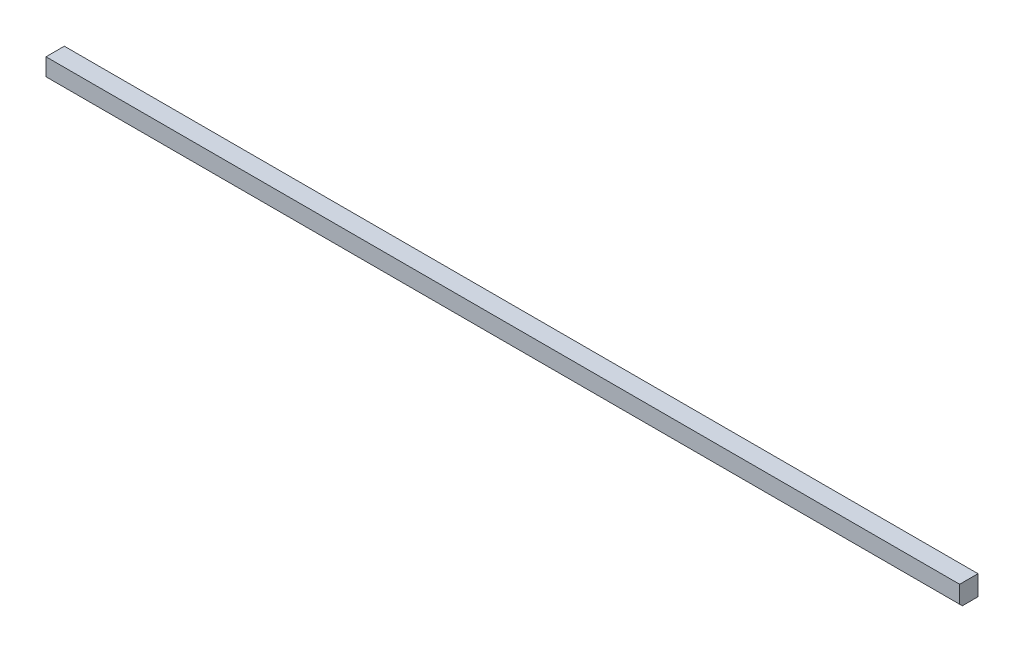
ISO-10303-21;
HEADER;
FILE_DESCRIPTION(('STEP AP214'),'2;1');
FILE_NAME('part.step','',(''),(''),'','','');
FILE_SCHEMA(('AUTOMOTIVE_DESIGN { 1 0 10303 214 1 1 1 1 }'));
ENDSEC;
DATA;
#1=APPLICATION_CONTEXT('core data for automotive mechanical design processes');
#2=APPLICATION_PROTOCOL_DEFINITION('international standard','automotive_design',2000,#1);
#3=PRODUCT_CONTEXT('',#1,'mechanical');
#4=PRODUCT('Part','Part','',(#3));
#5=PRODUCT_RELATED_PRODUCT_CATEGORY('part','',(#4));
#6=PRODUCT_DEFINITION_FORMATION('','',#4);
#7=PRODUCT_DEFINITION_CONTEXT('part definition',#1,'design');
#8=PRODUCT_DEFINITION('design','',#6,#7);
#9=PRODUCT_DEFINITION_SHAPE('','',#8);
#10=(LENGTH_UNIT() NAMED_UNIT(*) SI_UNIT(.MILLI.,.METRE.));
#11=(NAMED_UNIT(*) PLANE_ANGLE_UNIT() SI_UNIT($,.RADIAN.));
#12=(NAMED_UNIT(*) SI_UNIT($,.STERADIAN.) SOLID_ANGLE_UNIT());
#13=UNCERTAINTY_MEASURE_WITH_UNIT(LENGTH_MEASURE(1.E-05),#10,'distance_accuracy_value','');
#14=(GEOMETRIC_REPRESENTATION_CONTEXT(3) GLOBAL_UNCERTAINTY_ASSIGNED_CONTEXT((#13)) GLOBAL_UNIT_ASSIGNED_CONTEXT((#10,
#11,#12)) REPRESENTATION_CONTEXT('',''));
#15=CARTESIAN_POINT('',(0.,0.,0.));
#16=DIRECTION('',(0.,0.,1.));
#17=DIRECTION('',(1.,0.,0.));
#18=AXIS2_PLACEMENT_3D('',#15,#16,#17);
#19=CARTESIAN_POINT('',(0.,19.05,0.));
#20=DIRECTION('',(1.,0.,0.));
#21=DIRECTION('',(0.,0.,-1.));
#22=AXIS2_PLACEMENT_3D('',#19,#20,#21);
#23=PLANE('',#22);
#24=DIRECTION('',(0.,0.,1.));
#25=VECTOR('',#24,1.);
#26=CARTESIAN_POINT('',(0.,0.,0.));
#27=LINE('',#26,#25);
#28=CARTESIAN_POINT('',(0.,0.,-17.4625));
#29=VERTEX_POINT('',#28);
#30=CARTESIAN_POINT('',(0.,0.,-2.53999999999999));
#31=VERTEX_POINT('',#30);
#32=EDGE_CURVE('E124',#29,#31,#27,.T.);
#33=ORIENTED_EDGE('',*,*,#32,.T.);
#34=DIRECTION('',(0.,0.707106781186532,0.707106781186563));
#35=VECTOR('',#34,1.);
#36=CARTESIAN_POINT('',(0.,2.53999999999988,0.));
#37=LINE('',#36,#35);
#38=CARTESIAN_POINT('',(0.,2.53999999999988,0.));
#39=VERTEX_POINT('',#38);
#40=EDGE_CURVE('E11',#31,#39,#37,.T.);
#41=ORIENTED_EDGE('',*,*,#40,.T.);
#42=DIRECTION('',(0.,-1.,0.));
#43=VECTOR('',#42,1.);
#44=CARTESIAN_POINT('',(0.,19.05,0.));
#45=LINE('',#44,#43);
#46=CARTESIAN_POINT('',(0.,19.05,0.));
#47=VERTEX_POINT('',#46);
#48=EDGE_CURVE('E92',#47,#39,#45,.T.);
#49=ORIENTED_EDGE('',*,*,#48,.F.);
#50=DIRECTION('',(0.,0.,1.));
#51=VECTOR('',#50,1.);
#52=CARTESIAN_POINT('',(0.,19.05,0.));
#53=LINE('',#52,#51);
#54=CARTESIAN_POINT('',(0.,19.05,-17.4625));
#55=VERTEX_POINT('',#54);
#56=EDGE_CURVE('E98',#55,#47,#53,.T.);
#57=ORIENTED_EDGE('',*,*,#56,.F.);
#58=DIRECTION('',(0.,-1.,0.));
#59=VECTOR('',#58,1.);
#60=CARTESIAN_POINT('',(0.,19.05,-17.4625));
#61=LINE('',#60,#59);
#62=EDGE_CURVE('E119',#55,#29,#61,.T.);
#63=ORIENTED_EDGE('',*,*,#62,.T.);
#64=EDGE_LOOP('',(#33,#41,#49,#57,#63));
#65=FACE_BOUND('',#64,.T.);
#66=ADVANCED_FACE('F40',(#65),#23,.F.);
#67=CARTESIAN_POINT('',(0.,19.05,0.));
#68=DIRECTION('',(0.,0.,-1.));
#69=DIRECTION('',(-1.,0.,0.));
#70=AXIS2_PLACEMENT_3D('',#67,#68,#69);
#71=PLANE('',#70);
#72=ORIENTED_EDGE('',*,*,#48,.T.);
#73=DIRECTION('',(1.,0.,0.));
#74=VECTOR('',#73,1.);
#75=CARTESIAN_POINT('',(869.95,2.53999999999988,0.));
#76=LINE('',#75,#74);
#77=CARTESIAN_POINT('',(869.95,2.53999999999988,0.));
#78=VERTEX_POINT('',#77);
#79=EDGE_CURVE('E110',#39,#78,#76,.T.);
#80=ORIENTED_EDGE('',*,*,#79,.T.);
#81=DIRECTION('',(0.,-1.,0.));
#82=VECTOR('',#81,1.);
#83=CARTESIAN_POINT('',(869.95,19.05,0.));
#84=LINE('',#83,#82);
#85=CARTESIAN_POINT('',(869.95,19.05,0.));
#86=VERTEX_POINT('',#85);
#87=EDGE_CURVE('E94',#86,#78,#84,.T.);
#88=ORIENTED_EDGE('',*,*,#87,.F.);
#89=DIRECTION('',(1.,0.,0.));
#90=VECTOR('',#89,1.);
#91=CARTESIAN_POINT('',(0.,19.05,0.));
#92=LINE('',#91,#90);
#93=EDGE_CURVE('E87',#47,#86,#92,.T.);
#94=ORIENTED_EDGE('',*,*,#93,.F.);
#95=EDGE_LOOP('',(#72,#80,#88,#94));
#96=FACE_BOUND('',#95,.T.);
#97=ADVANCED_FACE('F89',(#96),#71,.F.);
#98=CARTESIAN_POINT('',(869.95,19.05,0.));
#99=DIRECTION('',(-1.,0.,0.));
#100=DIRECTION('',(0.,0.,1.));
#101=AXIS2_PLACEMENT_3D('',#98,#99,#100);
#102=PLANE('',#101);
#103=ORIENTED_EDGE('',*,*,#87,.T.);
#104=DIRECTION('',(0.,-0.707106781186532,-0.707106781186563));
#105=VECTOR('',#104,1.);
#106=CARTESIAN_POINT('',(869.95,2.53999999999988,0.));
#107=LINE('',#106,#105);
#108=CARTESIAN_POINT('',(869.95,0.,-2.53999999999999));
#109=VERTEX_POINT('',#108);
#110=EDGE_CURVE('E63',#78,#109,#107,.T.);
#111=ORIENTED_EDGE('',*,*,#110,.T.);
#112=DIRECTION('',(0.,0.,-1.));
#113=VECTOR('',#112,1.);
#114=CARTESIAN_POINT('',(869.95,0.,0.));
#115=LINE('',#114,#113);
#116=CARTESIAN_POINT('',(869.95,0.,-17.4625));
#117=VERTEX_POINT('',#116);
#118=EDGE_CURVE('E122',#109,#117,#115,.T.);
#119=ORIENTED_EDGE('',*,*,#118,.T.);
#120=DIRECTION('',(0.,-1.,0.));
#121=VECTOR('',#120,1.);
#122=CARTESIAN_POINT('',(869.95,19.05,-17.4625));
#123=LINE('',#122,#121);
#124=CARTESIAN_POINT('',(869.95,19.05,-17.4625));
#125=VERTEX_POINT('',#124);
#126=EDGE_CURVE('E113',#125,#117,#123,.T.);
#127=ORIENTED_EDGE('',*,*,#126,.F.);
#128=DIRECTION('',(0.,0.,-1.));
#129=VECTOR('',#128,1.);
#130=CARTESIAN_POINT('',(869.95,19.05,0.));
#131=LINE('',#130,#129);
#132=EDGE_CURVE('E97',#86,#125,#131,.T.);
#133=ORIENTED_EDGE('',*,*,#132,.F.);
#134=EDGE_LOOP('',(#103,#111,#119,#127,#133));
#135=FACE_BOUND('',#134,.T.);
#136=ADVANCED_FACE('F128',(#135),#102,.F.);
#137=CARTESIAN_POINT('',(0.,19.05,-17.4625));
#138=DIRECTION('',(0.,0.,1.));
#139=DIRECTION('',(1.,0.,0.));
#140=AXIS2_PLACEMENT_3D('',#137,#138,#139);
#141=PLANE('',#140);
#142=DIRECTION('',(-1.,0.,0.));
#143=VECTOR('',#142,1.);
#144=CARTESIAN_POINT('',(0.,0.,-17.4625));
#145=LINE('',#144,#143);
#146=EDGE_CURVE('E107',#117,#29,#145,.T.);
#147=ORIENTED_EDGE('',*,*,#146,.T.);
#148=ORIENTED_EDGE('',*,*,#62,.F.);
#149=DIRECTION('',(-1.,0.,0.));
#150=VECTOR('',#149,1.);
#151=CARTESIAN_POINT('',(0.,19.05,-17.4625));
#152=LINE('',#151,#150);
#153=EDGE_CURVE('E103',#125,#55,#152,.T.);
#154=ORIENTED_EDGE('',*,*,#153,.F.);
#155=ORIENTED_EDGE('',*,*,#126,.T.);
#156=EDGE_LOOP('',(#147,#148,#154,#155));
#157=FACE_BOUND('',#156,.T.);
#158=ADVANCED_FACE('F131',(#157),#141,.F.);
#159=CARTESIAN_POINT('',(0.,19.05,0.));
#160=DIRECTION('',(0.,-1.,0.));
#161=DIRECTION('',(0.,0.,-1.));
#162=AXIS2_PLACEMENT_3D('',#159,#160,#161);
#163=PLANE('',#162);
#164=ORIENTED_EDGE('',*,*,#56,.T.);
#165=ORIENTED_EDGE('',*,*,#93,.T.);
#166=ORIENTED_EDGE('',*,*,#132,.T.);
#167=ORIENTED_EDGE('',*,*,#153,.T.);
#168=EDGE_LOOP('',(#164,#165,#166,#167));
#169=FACE_BOUND('',#168,.T.);
#170=ADVANCED_FACE('F101',(#169),#163,.F.);
#171=CARTESIAN_POINT('',(0.,0.,0.));
#172=DIRECTION('',(0.,-1.,0.));
#173=DIRECTION('',(0.,0.,-1.));
#174=AXIS2_PLACEMENT_3D('',#171,#172,#173);
#175=PLANE('',#174);
#176=ORIENTED_EDGE('',*,*,#118,.F.);
#177=DIRECTION('',(-1.,0.,0.));
#178=VECTOR('',#177,1.);
#179=CARTESIAN_POINT('',(0.,0.,-2.53999999999999));
#180=LINE('',#179,#178);
#181=EDGE_CURVE('E49',#109,#31,#180,.T.);
#182=ORIENTED_EDGE('',*,*,#181,.T.);
#183=ORIENTED_EDGE('',*,*,#32,.F.);
#184=ORIENTED_EDGE('',*,*,#146,.F.);
#185=EDGE_LOOP('',(#176,#182,#183,#184));
#186=FACE_BOUND('',#185,.T.);
#187=ADVANCED_FACE('F132',(#186),#175,.T.);
#188=CARTESIAN_POINT('',(0.,2.53999999999988,0.));
#189=DIRECTION('',(0.,-0.707106781186563,0.707106781186532));
#190=DIRECTION('',(-1.,0.,0.));
#191=AXIS2_PLACEMENT_3D('',#188,#189,#190);
#192=PLANE('',#191);
#193=ORIENTED_EDGE('',*,*,#40,.F.);
#194=ORIENTED_EDGE('',*,*,#181,.F.);
#195=ORIENTED_EDGE('',*,*,#110,.F.);
#196=ORIENTED_EDGE('',*,*,#79,.F.);
#197=EDGE_LOOP('',(#193,#194,#195,#196));
#198=FACE_BOUND('',#197,.T.);
#199=ADVANCED_FACE('F43',(#198),#192,.T.);
#200=CLOSED_SHELL('',(#66,#97,#136,#158,#170,#187,#199));
#201=MANIFOLD_SOLID_BREP('B2',#200);
#202=ADVANCED_BREP_SHAPE_REPRESENTATION('',(#18,#201),#14);
#203=SHAPE_DEFINITION_REPRESENTATION(#9,#202);
ENDSEC;
END-ISO-10303-21;
